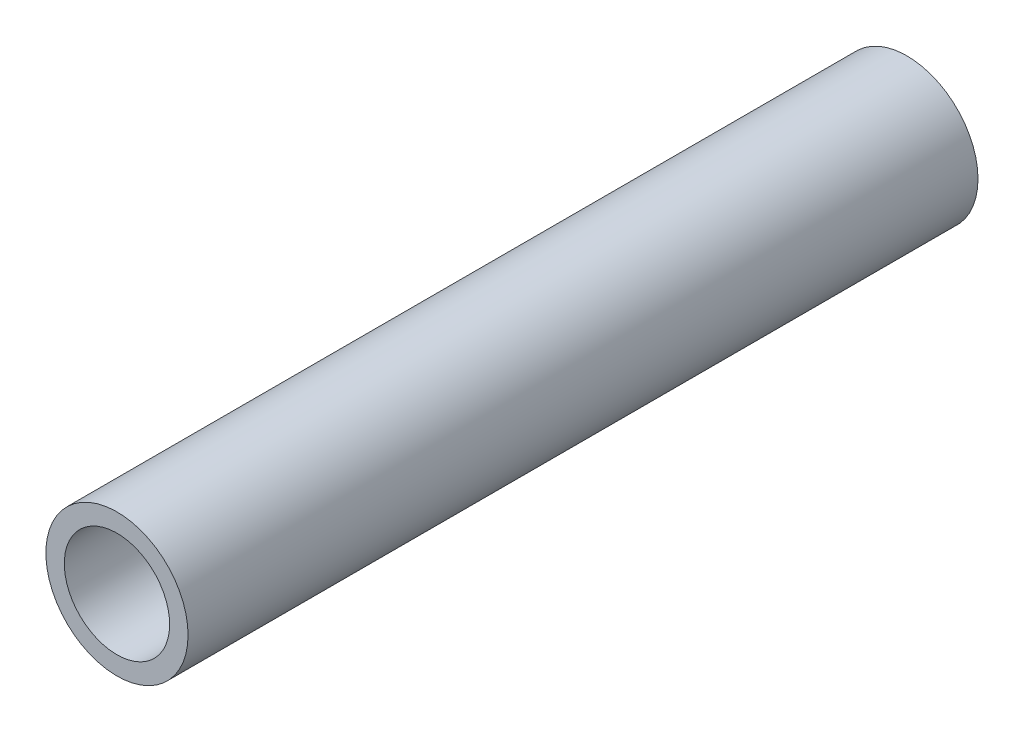
ISO-10303-21;
HEADER;
FILE_DESCRIPTION(('STEP AP214'),'2;1');
FILE_NAME('part.step','',(''),(''),'','','');
FILE_SCHEMA(('AUTOMOTIVE_DESIGN { 1 0 10303 214 1 1 1 1 }'));
ENDSEC;
DATA;
#1=APPLICATION_CONTEXT('core data for automotive mechanical design processes');
#2=APPLICATION_PROTOCOL_DEFINITION('international standard','automotive_design',2000,#1);
#3=PRODUCT_CONTEXT('',#1,'mechanical');
#4=PRODUCT('Part','Part','',(#3));
#5=PRODUCT_RELATED_PRODUCT_CATEGORY('part','',(#4));
#6=PRODUCT_DEFINITION_FORMATION('','',#4);
#7=PRODUCT_DEFINITION_CONTEXT('part definition',#1,'design');
#8=PRODUCT_DEFINITION('design','',#6,#7);
#9=PRODUCT_DEFINITION_SHAPE('','',#8);
#10=(LENGTH_UNIT() NAMED_UNIT(*) SI_UNIT(.MILLI.,.METRE.));
#11=(NAMED_UNIT(*) PLANE_ANGLE_UNIT() SI_UNIT($,.RADIAN.));
#12=(NAMED_UNIT(*) SI_UNIT($,.STERADIAN.) SOLID_ANGLE_UNIT());
#13=UNCERTAINTY_MEASURE_WITH_UNIT(LENGTH_MEASURE(1.E-05),#10,'distance_accuracy_value','');
#14=(GEOMETRIC_REPRESENTATION_CONTEXT(3) GLOBAL_UNCERTAINTY_ASSIGNED_CONTEXT((#13)) GLOBAL_UNIT_ASSIGNED_CONTEXT((#10,
#11,#12)) REPRESENTATION_CONTEXT('',''));
#15=CARTESIAN_POINT('',(0.,0.,0.));
#16=DIRECTION('',(0.,0.,1.));
#17=DIRECTION('',(1.,0.,0.));
#18=AXIS2_PLACEMENT_3D('',#15,#16,#17);
#19=CARTESIAN_POINT('',(0.,0.,15.));
#20=DIRECTION('',(0.,0.,1.));
#21=DIRECTION('',(1.,0.,0.));
#22=AXIS2_PLACEMENT_3D('',#19,#20,#21);
#23=PLANE('',#22);
#24=CARTESIAN_POINT('',(0.,0.,15.));
#25=DIRECTION('',(0.,0.,1.));
#26=DIRECTION('',(1.,0.,0.));
#27=AXIS2_PLACEMENT_3D('',#24,#25,#26);
#28=CIRCLE('',#27,1.35);
#29=CARTESIAN_POINT('',(1.35,0.,15.));
#30=VERTEX_POINT('',#29);
#31=EDGE_CURVE('E10',#30,#30,#28,.T.);
#32=ORIENTED_EDGE('',*,*,#31,.T.);
#33=EDGE_LOOP('',(#32));
#34=FACE_BOUND('',#33,.T.);
#35=CARTESIAN_POINT('',(0.,0.,15.));
#36=DIRECTION('',(0.,0.,1.));
#37=DIRECTION('',(1.,0.,0.));
#38=AXIS2_PLACEMENT_3D('',#35,#36,#37);
#39=CIRCLE('',#38,1.);
#40=CARTESIAN_POINT('',(1.,0.,15.));
#41=VERTEX_POINT('',#40);
#42=EDGE_CURVE('E41',#41,#41,#39,.T.);
#43=ORIENTED_EDGE('',*,*,#42,.F.);
#44=EDGE_LOOP('',(#43));
#45=FACE_BOUND('',#44,.T.);
#46=ADVANCED_FACE('F30',(#34,#45),#23,.T.);
#47=CARTESIAN_POINT('',(0.,0.,0.));
#48=DIRECTION('',(0.,0.,1.));
#49=DIRECTION('',(1.,0.,0.));
#50=AXIS2_PLACEMENT_3D('',#47,#48,#49);
#51=PLANE('',#50);
#52=CARTESIAN_POINT('',(0.,0.,0.));
#53=DIRECTION('',(0.,0.,1.));
#54=DIRECTION('',(1.,0.,0.));
#55=AXIS2_PLACEMENT_3D('',#52,#53,#54);
#56=CIRCLE('',#55,1.35);
#57=CARTESIAN_POINT('',(1.35,0.,0.));
#58=VERTEX_POINT('',#57);
#59=EDGE_CURVE('E34',#58,#58,#56,.T.);
#60=ORIENTED_EDGE('',*,*,#59,.F.);
#61=EDGE_LOOP('',(#60));
#62=FACE_BOUND('',#61,.T.);
#63=CARTESIAN_POINT('',(0.,0.,0.));
#64=DIRECTION('',(0.,0.,1.));
#65=DIRECTION('',(1.,0.,0.));
#66=AXIS2_PLACEMENT_3D('',#63,#64,#65);
#67=CIRCLE('',#66,1.);
#68=CARTESIAN_POINT('',(1.,0.,0.));
#69=VERTEX_POINT('',#68);
#70=EDGE_CURVE('E43',#69,#69,#67,.T.);
#71=ORIENTED_EDGE('',*,*,#70,.T.);
#72=EDGE_LOOP('',(#71));
#73=FACE_BOUND('',#72,.T.);
#74=ADVANCED_FACE('F53',(#62,#73),#51,.F.);
#75=CARTESIAN_POINT('',(0.,0.,15.));
#76=DIRECTION('',(0.,0.,-1.));
#77=DIRECTION('',(-1.,0.,0.));
#78=AXIS2_PLACEMENT_3D('',#75,#76,#77);
#79=CYLINDRICAL_SURFACE('',#78,1.35);
#80=ORIENTED_EDGE('',*,*,#31,.F.);
#81=EDGE_LOOP('',(#80));
#82=FACE_BOUND('',#81,.T.);
#83=ORIENTED_EDGE('',*,*,#59,.T.);
#84=EDGE_LOOP('',(#83));
#85=FACE_BOUND('',#84,.T.);
#86=ADVANCED_FACE('F32',(#82,#85),#79,.T.);
#87=CARTESIAN_POINT('',(0.,0.,15.));
#88=DIRECTION('',(0.,0.,-1.));
#89=DIRECTION('',(-1.,0.,0.));
#90=AXIS2_PLACEMENT_3D('',#87,#88,#89);
#91=CYLINDRICAL_SURFACE('',#90,1.);
#92=ORIENTED_EDGE('',*,*,#42,.T.);
#93=EDGE_LOOP('',(#92));
#94=FACE_BOUND('',#93,.T.);
#95=ORIENTED_EDGE('',*,*,#70,.F.);
#96=EDGE_LOOP('',(#95));
#97=FACE_BOUND('',#96,.T.);
#98=ADVANCED_FACE('F49',(#94,#97),#91,.F.);
#99=CLOSED_SHELL('',(#46,#74,#86,#98));
#100=MANIFOLD_SOLID_BREP('B2',#99);
#101=ADVANCED_BREP_SHAPE_REPRESENTATION('',(#18,#100),#14);
#102=SHAPE_DEFINITION_REPRESENTATION(#9,#101);
ENDSEC;
END-ISO-10303-21;
